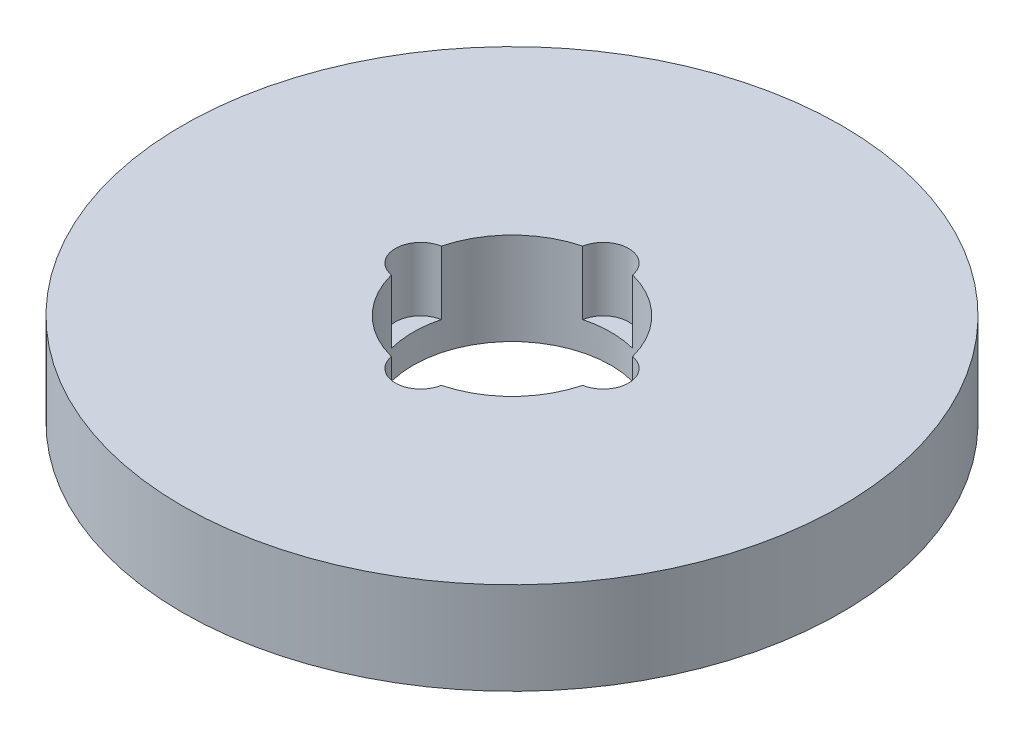
ISO-10303-21;
HEADER;
FILE_DESCRIPTION(('STEP AP214'),'2;1');
FILE_NAME('part.step','',(''),(''),'','','');
FILE_SCHEMA(('AUTOMOTIVE_DESIGN { 1 0 10303 214 1 1 1 1 }'));
ENDSEC;
DATA;
#1=APPLICATION_CONTEXT('core data for automotive mechanical design processes');
#2=APPLICATION_PROTOCOL_DEFINITION('international standard','automotive_design',2000,#1);
#3=PRODUCT_CONTEXT('',#1,'mechanical');
#4=PRODUCT('Part','Part','',(#3));
#5=PRODUCT_RELATED_PRODUCT_CATEGORY('part','',(#4));
#6=PRODUCT_DEFINITION_FORMATION('','',#4);
#7=PRODUCT_DEFINITION_CONTEXT('part definition',#1,'design');
#8=PRODUCT_DEFINITION('design','',#6,#7);
#9=PRODUCT_DEFINITION_SHAPE('','',#8);
#10=(LENGTH_UNIT() NAMED_UNIT(*) SI_UNIT(.MILLI.,.METRE.));
#11=(NAMED_UNIT(*) PLANE_ANGLE_UNIT() SI_UNIT($,.RADIAN.));
#12=(NAMED_UNIT(*) SI_UNIT($,.STERADIAN.) SOLID_ANGLE_UNIT());
#13=UNCERTAINTY_MEASURE_WITH_UNIT(LENGTH_MEASURE(1.E-05),#10,'distance_accuracy_value','');
#14=(GEOMETRIC_REPRESENTATION_CONTEXT(3) GLOBAL_UNCERTAINTY_ASSIGNED_CONTEXT((#13)) GLOBAL_UNIT_ASSIGNED_CONTEXT((#10,
#11,#12)) REPRESENTATION_CONTEXT('',''));
#15=CARTESIAN_POINT('',(0.,0.,0.));
#16=DIRECTION('',(0.,0.,1.));
#17=DIRECTION('',(1.,0.,0.));
#18=AXIS2_PLACEMENT_3D('',#15,#16,#17);
#19=CARTESIAN_POINT('',(0.,7.,0.));
#20=DIRECTION('',(0.,-1.,0.));
#21=DIRECTION('',(0.,0.,-1.));
#22=AXIS2_PLACEMENT_3D('',#19,#20,#21);
#23=CYLINDRICAL_SURFACE('',#22,25.);
#24=CARTESIAN_POINT('',(0.,7.,0.));
#25=DIRECTION('',(0.,1.,0.));
#26=DIRECTION('',(0.,0.,1.));
#27=AXIS2_PLACEMENT_3D('',#24,#25,#26);
#28=CIRCLE('',#27,25.);
#29=CARTESIAN_POINT('',(0.,7.,25.));
#30=VERTEX_POINT('',#29);
#31=EDGE_CURVE('E148',#30,#30,#28,.T.);
#32=ORIENTED_EDGE('',*,*,#31,.F.);
#33=EDGE_LOOP('',(#32));
#34=FACE_BOUND('',#33,.T.);
#35=CARTESIAN_POINT('',(0.,0.,0.));
#36=DIRECTION('',(0.,1.,0.));
#37=DIRECTION('',(0.,0.,1.));
#38=AXIS2_PLACEMENT_3D('',#35,#36,#37);
#39=CIRCLE('',#38,25.);
#40=CARTESIAN_POINT('',(0.,0.,25.));
#41=VERTEX_POINT('',#40);
#42=EDGE_CURVE('E139',#41,#41,#39,.T.);
#43=ORIENTED_EDGE('',*,*,#42,.T.);
#44=EDGE_LOOP('',(#43));
#45=FACE_BOUND('',#44,.T.);
#46=ADVANCED_FACE('F39',(#34,#45),#23,.T.);
#47=CARTESIAN_POINT('',(0.,7.,0.));
#48=DIRECTION('',(0.,1.,0.));
#49=DIRECTION('',(0.,0.,1.));
#50=AXIS2_PLACEMENT_3D('',#47,#48,#49);
#51=PLANE('',#50);
#52=CARTESIAN_POINT('',(0.,7.,6.92212196412882));
#53=DIRECTION('',(0.,1.,0.));
#54=DIRECTION('',(1.,0.,0.));
#55=AXIS2_PLACEMENT_3D('',#52,#53,#54);
#56=CIRCLE('',#55,1.92244286933098);
#57=CARTESIAN_POINT('',(-1.89302182151465,7.,7.25716669115912));
#58=VERTEX_POINT('',#57);
#59=CARTESIAN_POINT('',(1.8930218215147,7.,7.2571666911591));
#60=VERTEX_POINT('',#59);
#61=EDGE_CURVE('E175',#58,#60,#56,.T.);
#62=ORIENTED_EDGE('',*,*,#61,.F.);
#63=CARTESIAN_POINT('',(0.,7.,0.));
#64=DIRECTION('',(0.,1.,0.));
#65=DIRECTION('',(0.,0.,1.));
#66=AXIS2_PLACEMENT_3D('',#63,#64,#65);
#67=CIRCLE('',#66,7.5);
#68=CARTESIAN_POINT('',(-7.25716669115911,7.,1.89302182151468));
#69=VERTEX_POINT('',#68);
#70=EDGE_CURVE('E134',#69,#58,#67,.T.);
#71=ORIENTED_EDGE('',*,*,#70,.F.);
#72=CARTESIAN_POINT('',(-6.92212196412882,7.,0.));
#73=DIRECTION('',(0.,1.,0.));
#74=DIRECTION('',(0.,0.,1.));
#75=AXIS2_PLACEMENT_3D('',#72,#73,#74);
#76=CIRCLE('',#75,1.92244286933098);
#77=CARTESIAN_POINT('',(-7.25716669115911,7.,-1.89302182151468));
#78=VERTEX_POINT('',#77);
#79=EDGE_CURVE('E143',#78,#69,#76,.T.);
#80=ORIENTED_EDGE('',*,*,#79,.F.);
#81=CARTESIAN_POINT('',(-1.89302182151475,7.,-7.25716669115909));
#82=VERTEX_POINT('',#81);
#83=EDGE_CURVE('E123',#82,#78,#67,.T.);
#84=ORIENTED_EDGE('',*,*,#83,.F.);
#85=CARTESIAN_POINT('',(0.,7.,-6.92212196412882));
#86=DIRECTION('',(0.,1.,0.));
#87=DIRECTION('',(-1.,0.,0.));
#88=AXIS2_PLACEMENT_3D('',#85,#86,#87);
#89=CIRCLE('',#88,1.92244286933098);
#90=CARTESIAN_POINT('',(1.8930218215146,7.,-7.25716669115913));
#91=VERTEX_POINT('',#90);
#92=EDGE_CURVE('E106',#91,#82,#89,.T.);
#93=ORIENTED_EDGE('',*,*,#92,.F.);
#94=CARTESIAN_POINT('',(7.25716669115911,7.,-1.89302182151468));
#95=VERTEX_POINT('',#94);
#96=EDGE_CURVE('E125',#95,#91,#67,.T.);
#97=ORIENTED_EDGE('',*,*,#96,.F.);
#98=CARTESIAN_POINT('',(6.92212196412882,7.,0.));
#99=DIRECTION('',(0.,1.,0.));
#100=DIRECTION('',(0.,0.,-1.));
#101=AXIS2_PLACEMENT_3D('',#98,#99,#100);
#102=CIRCLE('',#101,1.92244286933098);
#103=CARTESIAN_POINT('',(7.25716669115911,7.,1.89302182151468));
#104=VERTEX_POINT('',#103);
#105=EDGE_CURVE('E286',#104,#95,#102,.T.);
#106=ORIENTED_EDGE('',*,*,#105,.F.);
#107=EDGE_CURVE('E135',#60,#104,#67,.T.);
#108=ORIENTED_EDGE('',*,*,#107,.F.);
#109=EDGE_LOOP('',(#62,#71,#80,#84,#93,#97,#106,#108));
#110=FACE_BOUND('',#109,.T.);
#111=ORIENTED_EDGE('',*,*,#31,.T.);
#112=EDGE_LOOP('',(#111));
#113=FACE_BOUND('',#112,.T.);
#114=ADVANCED_FACE('F118',(#110,#113),#51,.T.);
#115=CARTESIAN_POINT('',(0.,0.,0.));
#116=DIRECTION('',(0.,1.,0.));
#117=DIRECTION('',(0.,0.,1.));
#118=AXIS2_PLACEMENT_3D('',#115,#116,#117);
#119=PLANE('',#118);
#120=CARTESIAN_POINT('',(0.,0.,0.));
#121=DIRECTION('',(0.,1.,0.));
#122=DIRECTION('',(0.,0.,1.));
#123=AXIS2_PLACEMENT_3D('',#120,#121,#122);
#124=CIRCLE('',#123,7.5);
#125=CARTESIAN_POINT('',(0.,0.,7.5));
#126=VERTEX_POINT('',#125);
#127=EDGE_CURVE('E136',#126,#126,#124,.T.);
#128=ORIENTED_EDGE('',*,*,#127,.T.);
#129=EDGE_LOOP('',(#128));
#130=FACE_BOUND('',#129,.T.);
#131=ORIENTED_EDGE('',*,*,#42,.F.);
#132=EDGE_LOOP('',(#131));
#133=FACE_BOUND('',#132,.T.);
#134=ADVANCED_FACE('F187',(#130,#133),#119,.F.);
#135=CARTESIAN_POINT('',(0.,7.,0.));
#136=DIRECTION('',(0.,-1.,0.));
#137=DIRECTION('',(0.,0.,-1.));
#138=AXIS2_PLACEMENT_3D('',#135,#136,#137);
#139=CYLINDRICAL_SURFACE('',#138,7.5);
#140=DIRECTION('',(0.,1.,0.));
#141=VECTOR('',#140,1.);
#142=CARTESIAN_POINT('',(-1.89302182151465,4.58692197348009,7.25716669115911));
#143=LINE('',#142,#141);
#144=CARTESIAN_POINT('',(-1.89302182151465,2.17384394696017,7.25716669115912));
#145=VERTEX_POINT('',#144);
#146=EDGE_CURVE('E11',#145,#58,#143,.T.);
#147=ORIENTED_EDGE('',*,*,#146,.F.);
#148=CARTESIAN_POINT('',(0.,2.17384394696017,0.));
#149=DIRECTION('',(0.,1.,0.));
#150=DIRECTION('',(0.,0.,1.));
#151=AXIS2_PLACEMENT_3D('',#148,#149,#150);
#152=CIRCLE('',#151,7.5);
#153=CARTESIAN_POINT('',(1.8930218215147,2.17384394696017,7.2571666911591));
#154=VERTEX_POINT('',#153);
#155=EDGE_CURVE('E170',#145,#154,#152,.T.);
#156=ORIENTED_EDGE('',*,*,#155,.T.);
#157=DIRECTION('',(0.,1.,0.));
#158=VECTOR('',#157,1.);
#159=CARTESIAN_POINT('',(1.8930218215147,4.58692197348009,7.2571666911591));
#160=LINE('',#159,#158);
#161=EDGE_CURVE('E46',#60,#154,#160,.F.);
#162=ORIENTED_EDGE('',*,*,#161,.F.);
#163=ORIENTED_EDGE('',*,*,#107,.T.);
#164=DIRECTION('',(0.,1.,0.));
#165=VECTOR('',#164,1.);
#166=CARTESIAN_POINT('',(7.25716669115911,4.58692197348009,1.89302182151468));
#167=LINE('',#166,#165);
#168=CARTESIAN_POINT('',(7.25716669115911,2.17384394696017,1.89302182151468));
#169=VERTEX_POINT('',#168);
#170=EDGE_CURVE('E164',#169,#104,#167,.T.);
#171=ORIENTED_EDGE('',*,*,#170,.F.);
#172=CARTESIAN_POINT('',(0.,2.17384394696017,0.));
#173=DIRECTION('',(0.,1.,0.));
#174=DIRECTION('',(0.,0.,1.));
#175=AXIS2_PLACEMENT_3D('',#172,#173,#174);
#176=CIRCLE('',#175,7.5);
#177=CARTESIAN_POINT('',(7.25716669115911,2.17384394696017,-1.89302182151468));
#178=VERTEX_POINT('',#177);
#179=EDGE_CURVE('E115',#169,#178,#176,.T.);
#180=ORIENTED_EDGE('',*,*,#179,.T.);
#181=DIRECTION('',(0.,1.,0.));
#182=VECTOR('',#181,1.);
#183=CARTESIAN_POINT('',(7.25716669115911,4.58692197348009,-1.89302182151468));
#184=LINE('',#183,#182);
#185=EDGE_CURVE('E131',#95,#178,#184,.F.);
#186=ORIENTED_EDGE('',*,*,#185,.F.);
#187=ORIENTED_EDGE('',*,*,#96,.T.);
#188=DIRECTION('',(0.,1.,0.));
#189=VECTOR('',#188,1.);
#190=CARTESIAN_POINT('',(1.8930218215146,4.58692197348009,-7.25716669115913));
#191=LINE('',#190,#189);
#192=CARTESIAN_POINT('',(1.8930218215146,2.17384394696017,-7.25716669115913));
#193=VERTEX_POINT('',#192);
#194=EDGE_CURVE('E105',#193,#91,#191,.T.);
#195=ORIENTED_EDGE('',*,*,#194,.F.);
#196=CARTESIAN_POINT('',(0.,2.17384394696017,0.));
#197=DIRECTION('',(0.,1.,0.));
#198=DIRECTION('',(0.,0.,1.));
#199=AXIS2_PLACEMENT_3D('',#196,#197,#198);
#200=CIRCLE('',#199,7.5);
#201=CARTESIAN_POINT('',(-1.89302182151475,2.17384394696017,-7.25716669115909));
#202=VERTEX_POINT('',#201);
#203=EDGE_CURVE('E159',#193,#202,#200,.T.);
#204=ORIENTED_EDGE('',*,*,#203,.T.);
#205=DIRECTION('',(0.,1.,0.));
#206=VECTOR('',#205,1.);
#207=CARTESIAN_POINT('',(-1.89302182151475,4.58692197348009,-7.25716669115909));
#208=LINE('',#207,#206);
#209=EDGE_CURVE('E114',#82,#202,#208,.F.);
#210=ORIENTED_EDGE('',*,*,#209,.F.);
#211=ORIENTED_EDGE('',*,*,#83,.T.);
#212=DIRECTION('',(0.,1.,0.));
#213=VECTOR('',#212,1.);
#214=CARTESIAN_POINT('',(-7.25716669115911,4.58692197348009,-1.89302182151468));
#215=LINE('',#214,#213);
#216=CARTESIAN_POINT('',(-7.25716669115911,2.17384394696017,-1.89302182151468));
#217=VERTEX_POINT('',#216);
#218=EDGE_CURVE('E160',#217,#78,#215,.T.);
#219=ORIENTED_EDGE('',*,*,#218,.F.);
#220=CARTESIAN_POINT('',(0.,2.17384394696017,0.));
#221=DIRECTION('',(0.,1.,0.));
#222=DIRECTION('',(0.,0.,1.));
#223=AXIS2_PLACEMENT_3D('',#220,#221,#222);
#224=CIRCLE('',#223,7.5);
#225=CARTESIAN_POINT('',(-7.25716669115911,2.17384394696017,1.89302182151468));
#226=VERTEX_POINT('',#225);
#227=EDGE_CURVE('E149',#217,#226,#224,.T.);
#228=ORIENTED_EDGE('',*,*,#227,.T.);
#229=DIRECTION('',(0.,1.,0.));
#230=VECTOR('',#229,1.);
#231=CARTESIAN_POINT('',(-7.25716669115911,4.58692197348009,1.89302182151468));
#232=LINE('',#231,#230);
#233=EDGE_CURVE('E152',#69,#226,#232,.F.);
#234=ORIENTED_EDGE('',*,*,#233,.F.);
#235=ORIENTED_EDGE('',*,*,#70,.T.);
#236=EDGE_LOOP('',(#147,#156,#162,#163,#171,#180,#186,#187,#195,#204,#210,#211,#219,#228,#234,#235));
#237=FACE_BOUND('',#236,.T.);
#238=ORIENTED_EDGE('',*,*,#127,.F.);
#239=EDGE_LOOP('',(#238));
#240=FACE_BOUND('',#239,.T.);
#241=ADVANCED_FACE('F126',(#237,#240),#139,.F.);
#242=CARTESIAN_POINT('',(-6.92212196412882,2.17384394696017,0.));
#243=DIRECTION('',(0.,1.,0.));
#244=DIRECTION('',(0.,0.,1.));
#245=AXIS2_PLACEMENT_3D('',#242,#243,#244);
#246=CYLINDRICAL_SURFACE('',#245,1.92244286933098);
#247=ORIENTED_EDGE('',*,*,#218,.T.);
#248=ORIENTED_EDGE('',*,*,#79,.T.);
#249=ORIENTED_EDGE('',*,*,#233,.T.);
#250=CARTESIAN_POINT('',(-6.92212196412882,2.17384394696017,0.));
#251=DIRECTION('',(0.,1.,0.));
#252=DIRECTION('',(0.,0.,1.));
#253=AXIS2_PLACEMENT_3D('',#250,#251,#252);
#254=CIRCLE('',#253,1.92244286933098);
#255=EDGE_CURVE('E144',#217,#226,#254,.T.);
#256=ORIENTED_EDGE('',*,*,#255,.F.);
#257=EDGE_LOOP('',(#247,#248,#249,#256));
#258=FACE_BOUND('',#257,.T.);
#259=ADVANCED_FACE('F200',(#258),#246,.F.);
#260=CARTESIAN_POINT('',(-6.92212196412882,2.17384394696017,0.));
#261=DIRECTION('',(0.,1.,0.));
#262=DIRECTION('',(0.,0.,1.));
#263=AXIS2_PLACEMENT_3D('',#260,#261,#262);
#264=PLANE('',#263);
#265=ORIENTED_EDGE('',*,*,#255,.T.);
#266=ORIENTED_EDGE('',*,*,#227,.F.);
#267=EDGE_LOOP('',(#265,#266));
#268=FACE_BOUND('',#267,.T.);
#269=ADVANCED_FACE('F201',(#268),#264,.T.);
#270=CARTESIAN_POINT('',(0.,2.17384394696017,-6.92212196412882));
#271=DIRECTION('',(0.,1.,0.));
#272=DIRECTION('',(0.,0.,1.));
#273=AXIS2_PLACEMENT_3D('',#270,#271,#272);
#274=CYLINDRICAL_SURFACE('',#273,1.92244286933098);
#275=ORIENTED_EDGE('',*,*,#194,.T.);
#276=ORIENTED_EDGE('',*,*,#92,.T.);
#277=ORIENTED_EDGE('',*,*,#209,.T.);
#278=CARTESIAN_POINT('',(0.,2.17384394696017,-6.92212196412882));
#279=DIRECTION('',(0.,1.,0.));
#280=DIRECTION('',(-1.,0.,0.));
#281=AXIS2_PLACEMENT_3D('',#278,#279,#280);
#282=CIRCLE('',#281,1.92244286933098);
#283=EDGE_CURVE('E107',#193,#202,#282,.T.);
#284=ORIENTED_EDGE('',*,*,#283,.F.);
#285=EDGE_LOOP('',(#275,#276,#277,#284));
#286=FACE_BOUND('',#285,.T.);
#287=ADVANCED_FACE('F102',(#286),#274,.F.);
#288=CARTESIAN_POINT('',(0.,2.17384394696017,-6.92212196412882));
#289=DIRECTION('',(0.,1.,0.));
#290=DIRECTION('',(-1.,0.,0.));
#291=AXIS2_PLACEMENT_3D('',#288,#289,#290);
#292=PLANE('',#291);
#293=ORIENTED_EDGE('',*,*,#283,.T.);
#294=ORIENTED_EDGE('',*,*,#203,.F.);
#295=EDGE_LOOP('',(#293,#294));
#296=FACE_BOUND('',#295,.T.);
#297=ADVANCED_FACE('F209',(#296),#292,.T.);
#298=CARTESIAN_POINT('',(6.92212196412882,2.17384394696017,0.));
#299=DIRECTION('',(0.,1.,0.));
#300=DIRECTION('',(0.,0.,1.));
#301=AXIS2_PLACEMENT_3D('',#298,#299,#300);
#302=CYLINDRICAL_SURFACE('',#301,1.92244286933098);
#303=ORIENTED_EDGE('',*,*,#170,.T.);
#304=ORIENTED_EDGE('',*,*,#105,.T.);
#305=ORIENTED_EDGE('',*,*,#185,.T.);
#306=CARTESIAN_POINT('',(6.92212196412882,2.17384394696017,0.));
#307=DIRECTION('',(0.,1.,0.));
#308=DIRECTION('',(0.,0.,-1.));
#309=AXIS2_PLACEMENT_3D('',#306,#307,#308);
#310=CIRCLE('',#309,1.92244286933098);
#311=EDGE_CURVE('E56',#169,#178,#310,.T.);
#312=ORIENTED_EDGE('',*,*,#311,.F.);
#313=EDGE_LOOP('',(#303,#304,#305,#312));
#314=FACE_BOUND('',#313,.T.);
#315=ADVANCED_FACE('F213',(#314),#302,.F.);
#316=CARTESIAN_POINT('',(6.92212196412882,2.17384394696017,0.));
#317=DIRECTION('',(0.,1.,0.));
#318=DIRECTION('',(0.,0.,-1.));
#319=AXIS2_PLACEMENT_3D('',#316,#317,#318);
#320=PLANE('',#319);
#321=ORIENTED_EDGE('',*,*,#311,.T.);
#322=ORIENTED_EDGE('',*,*,#179,.F.);
#323=EDGE_LOOP('',(#321,#322));
#324=FACE_BOUND('',#323,.T.);
#325=ADVANCED_FACE('F179',(#324),#320,.T.);
#326=CARTESIAN_POINT('',(0.,2.17384394696017,6.92212196412882));
#327=DIRECTION('',(0.,1.,0.));
#328=DIRECTION('',(0.,0.,1.));
#329=AXIS2_PLACEMENT_3D('',#326,#327,#328);
#330=CYLINDRICAL_SURFACE('',#329,1.92244286933098);
#331=ORIENTED_EDGE('',*,*,#146,.T.);
#332=ORIENTED_EDGE('',*,*,#61,.T.);
#333=ORIENTED_EDGE('',*,*,#161,.T.);
#334=CARTESIAN_POINT('',(0.,2.17384394696017,6.92212196412882));
#335=DIRECTION('',(0.,1.,0.));
#336=DIRECTION('',(1.,0.,0.));
#337=AXIS2_PLACEMENT_3D('',#334,#335,#336);
#338=CIRCLE('',#337,1.92244286933098);
#339=EDGE_CURVE('E55',#145,#154,#338,.T.);
#340=ORIENTED_EDGE('',*,*,#339,.F.);
#341=EDGE_LOOP('',(#331,#332,#333,#340));
#342=FACE_BOUND('',#341,.T.);
#343=ADVANCED_FACE('F171',(#342),#330,.F.);
#344=CARTESIAN_POINT('',(0.,2.17384394696017,6.92212196412882));
#345=DIRECTION('',(0.,1.,0.));
#346=DIRECTION('',(1.,0.,0.));
#347=AXIS2_PLACEMENT_3D('',#344,#345,#346);
#348=PLANE('',#347);
#349=ORIENTED_EDGE('',*,*,#339,.T.);
#350=ORIENTED_EDGE('',*,*,#155,.F.);
#351=EDGE_LOOP('',(#349,#350));
#352=FACE_BOUND('',#351,.T.);
#353=ADVANCED_FACE('F173',(#352),#348,.T.);
#354=CLOSED_SHELL('',(#46,#114,#134,#241,#259,#269,#287,#297,#315,#325,#343,#353));
#355=MANIFOLD_SOLID_BREP('B2',#354);
#356=ADVANCED_BREP_SHAPE_REPRESENTATION('',(#18,#355),#14);
#357=SHAPE_DEFINITION_REPRESENTATION(#9,#356);
ENDSEC;
END-ISO-10303-21;
